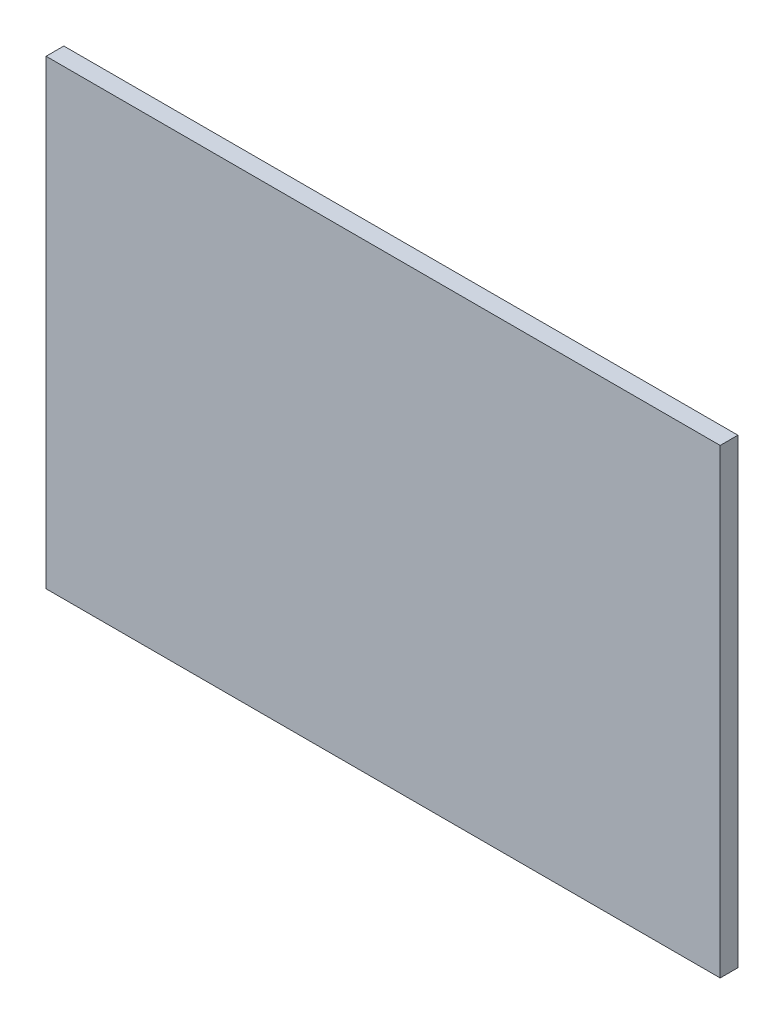
ISO-10303-21;
HEADER;
FILE_DESCRIPTION(('STEP AP214'),'2;1');
FILE_NAME('part.step','',(''),(''),'','','');
FILE_SCHEMA(('AUTOMOTIVE_DESIGN { 1 0 10303 214 1 1 1 1 }'));
ENDSEC;
DATA;
#1=APPLICATION_CONTEXT('core data for automotive mechanical design processes');
#2=APPLICATION_PROTOCOL_DEFINITION('international standard','automotive_design',2000,#1);
#3=PRODUCT_CONTEXT('',#1,'mechanical');
#4=PRODUCT('Part','Part','',(#3));
#5=PRODUCT_RELATED_PRODUCT_CATEGORY('part','',(#4));
#6=PRODUCT_DEFINITION_FORMATION('','',#4);
#7=PRODUCT_DEFINITION_CONTEXT('part definition',#1,'design');
#8=PRODUCT_DEFINITION('design','',#6,#7);
#9=PRODUCT_DEFINITION_SHAPE('','',#8);
#10=(LENGTH_UNIT() NAMED_UNIT(*) SI_UNIT(.MILLI.,.METRE.));
#11=(NAMED_UNIT(*) PLANE_ANGLE_UNIT() SI_UNIT($,.RADIAN.));
#12=(NAMED_UNIT(*) SI_UNIT($,.STERADIAN.) SOLID_ANGLE_UNIT());
#13=UNCERTAINTY_MEASURE_WITH_UNIT(LENGTH_MEASURE(1.E-05),#10,'distance_accuracy_value','');
#14=(GEOMETRIC_REPRESENTATION_CONTEXT(3) GLOBAL_UNCERTAINTY_ASSIGNED_CONTEXT((#13)) GLOBAL_UNIT_ASSIGNED_CONTEXT((#10,
#11,#12)) REPRESENTATION_CONTEXT('',''));
#15=CARTESIAN_POINT('',(0.,0.,0.));
#16=DIRECTION('',(0.,0.,1.));
#17=DIRECTION('',(1.,0.,0.));
#18=AXIS2_PLACEMENT_3D('',#15,#16,#17);
#19=CARTESIAN_POINT('',(0.,0.,1.));
#20=DIRECTION('',(1.,0.,0.));
#21=DIRECTION('',(0.,0.,-1.));
#22=AXIS2_PLACEMENT_3D('',#19,#20,#21);
#23=PLANE('',#22);
#24=DIRECTION('',(0.,-1.,0.));
#25=VECTOR('',#24,1.);
#26=CARTESIAN_POINT('',(0.,0.,0.));
#27=LINE('',#26,#25);
#28=CARTESIAN_POINT('',(0.,26.,0.));
#29=VERTEX_POINT('',#28);
#30=CARTESIAN_POINT('',(0.,0.,0.));
#31=VERTEX_POINT('',#30);
#32=EDGE_CURVE('E107',#29,#31,#27,.T.);
#33=ORIENTED_EDGE('',*,*,#32,.T.);
#34=DIRECTION('',(0.,0.,-1.));
#35=VECTOR('',#34,1.);
#36=CARTESIAN_POINT('',(0.,0.,1.));
#37=LINE('',#36,#35);
#38=CARTESIAN_POINT('',(0.,0.,1.));
#39=VERTEX_POINT('',#38);
#40=EDGE_CURVE('E11',#39,#31,#37,.T.);
#41=ORIENTED_EDGE('',*,*,#40,.F.);
#42=DIRECTION('',(0.,-1.,0.));
#43=VECTOR('',#42,1.);
#44=CARTESIAN_POINT('',(0.,0.,1.));
#45=LINE('',#44,#43);
#46=CARTESIAN_POINT('',(0.,26.,1.));
#47=VERTEX_POINT('',#46);
#48=EDGE_CURVE('E91',#47,#39,#45,.T.);
#49=ORIENTED_EDGE('',*,*,#48,.F.);
#50=DIRECTION('',(0.,0.,-1.));
#51=VECTOR('',#50,1.);
#52=CARTESIAN_POINT('',(0.,26.,1.));
#53=LINE('',#52,#51);
#54=EDGE_CURVE('E103',#47,#29,#53,.T.);
#55=ORIENTED_EDGE('',*,*,#54,.T.);
#56=EDGE_LOOP('',(#33,#41,#49,#55));
#57=FACE_BOUND('',#56,.T.);
#58=ADVANCED_FACE('F39',(#57),#23,.F.);
#59=CARTESIAN_POINT('',(0.,0.,1.));
#60=DIRECTION('',(0.,1.,0.));
#61=DIRECTION('',(0.,0.,1.));
#62=AXIS2_PLACEMENT_3D('',#59,#60,#61);
#63=PLANE('',#62);
#64=DIRECTION('',(1.,0.,0.));
#65=VECTOR('',#64,1.);
#66=CARTESIAN_POINT('',(0.,0.,0.));
#67=LINE('',#66,#65);
#68=CARTESIAN_POINT('',(38.,0.,0.));
#69=VERTEX_POINT('',#68);
#70=EDGE_CURVE('E96',#31,#69,#67,.T.);
#71=ORIENTED_EDGE('',*,*,#70,.T.);
#72=DIRECTION('',(0.,0.,-1.));
#73=VECTOR('',#72,1.);
#74=CARTESIAN_POINT('',(38.,0.,1.));
#75=LINE('',#74,#73);
#76=CARTESIAN_POINT('',(38.,0.,1.));
#77=VERTEX_POINT('',#76);
#78=EDGE_CURVE('E48',#77,#69,#75,.T.);
#79=ORIENTED_EDGE('',*,*,#78,.F.);
#80=DIRECTION('',(1.,0.,0.));
#81=VECTOR('',#80,1.);
#82=CARTESIAN_POINT('',(0.,0.,1.));
#83=LINE('',#82,#81);
#84=EDGE_CURVE('E86',#39,#77,#83,.T.);
#85=ORIENTED_EDGE('',*,*,#84,.F.);
#86=ORIENTED_EDGE('',*,*,#40,.T.);
#87=EDGE_LOOP('',(#71,#79,#85,#86));
#88=FACE_BOUND('',#87,.T.);
#89=ADVANCED_FACE('F95',(#88),#63,.F.);
#90=CARTESIAN_POINT('',(38.,0.,1.));
#91=DIRECTION('',(-1.,0.,0.));
#92=DIRECTION('',(0.,0.,1.));
#93=AXIS2_PLACEMENT_3D('',#90,#91,#92);
#94=PLANE('',#93);
#95=DIRECTION('',(0.,1.,0.));
#96=VECTOR('',#95,1.);
#97=CARTESIAN_POINT('',(38.,0.,0.));
#98=LINE('',#97,#96);
#99=CARTESIAN_POINT('',(38.,26.,0.));
#100=VERTEX_POINT('',#99);
#101=EDGE_CURVE('E73',#69,#100,#98,.T.);
#102=ORIENTED_EDGE('',*,*,#101,.T.);
#103=DIRECTION('',(0.,0.,-1.));
#104=VECTOR('',#103,1.);
#105=CARTESIAN_POINT('',(38.,26.,1.));
#106=LINE('',#105,#104);
#107=CARTESIAN_POINT('',(38.,26.,1.));
#108=VERTEX_POINT('',#107);
#109=EDGE_CURVE('E98',#108,#100,#106,.T.);
#110=ORIENTED_EDGE('',*,*,#109,.F.);
#111=DIRECTION('',(0.,1.,0.));
#112=VECTOR('',#111,1.);
#113=CARTESIAN_POINT('',(38.,0.,1.));
#114=LINE('',#113,#112);
#115=EDGE_CURVE('E89',#77,#108,#114,.T.);
#116=ORIENTED_EDGE('',*,*,#115,.F.);
#117=ORIENTED_EDGE('',*,*,#78,.T.);
#118=EDGE_LOOP('',(#102,#110,#116,#117));
#119=FACE_BOUND('',#118,.T.);
#120=ADVANCED_FACE('F99',(#119),#94,.F.);
#121=CARTESIAN_POINT('',(0.,26.,1.));
#122=DIRECTION('',(0.,-1.,0.));
#123=DIRECTION('',(0.,0.,-1.));
#124=AXIS2_PLACEMENT_3D('',#121,#122,#123);
#125=PLANE('',#124);
#126=DIRECTION('',(-1.,0.,0.));
#127=VECTOR('',#126,1.);
#128=CARTESIAN_POINT('',(0.,26.,0.));
#129=LINE('',#128,#127);
#130=EDGE_CURVE('E79',#100,#29,#129,.T.);
#131=ORIENTED_EDGE('',*,*,#130,.T.);
#132=ORIENTED_EDGE('',*,*,#54,.F.);
#133=DIRECTION('',(-1.,0.,0.));
#134=VECTOR('',#133,1.);
#135=CARTESIAN_POINT('',(0.,26.,1.));
#136=LINE('',#135,#134);
#137=EDGE_CURVE('E56',#108,#47,#136,.T.);
#138=ORIENTED_EDGE('',*,*,#137,.F.);
#139=ORIENTED_EDGE('',*,*,#109,.T.);
#140=EDGE_LOOP('',(#131,#132,#138,#139));
#141=FACE_BOUND('',#140,.T.);
#142=ADVANCED_FACE('F120',(#141),#125,.F.);
#143=CARTESIAN_POINT('',(0.,0.,1.));
#144=DIRECTION('',(0.,0.,-1.));
#145=DIRECTION('',(-1.,0.,0.));
#146=AXIS2_PLACEMENT_3D('',#143,#144,#145);
#147=PLANE('',#146);
#148=ORIENTED_EDGE('',*,*,#48,.T.);
#149=ORIENTED_EDGE('',*,*,#84,.T.);
#150=ORIENTED_EDGE('',*,*,#115,.T.);
#151=ORIENTED_EDGE('',*,*,#137,.T.);
#152=EDGE_LOOP('',(#148,#149,#150,#151));
#153=FACE_BOUND('',#152,.T.);
#154=ADVANCED_FACE('F87',(#153),#147,.F.);
#155=CARTESIAN_POINT('',(0.,0.,0.));
#156=DIRECTION('',(0.,0.,-1.));
#157=DIRECTION('',(-1.,0.,0.));
#158=AXIS2_PLACEMENT_3D('',#155,#156,#157);
#159=PLANE('',#158);
#160=ORIENTED_EDGE('',*,*,#32,.F.);
#161=ORIENTED_EDGE('',*,*,#130,.F.);
#162=ORIENTED_EDGE('',*,*,#101,.F.);
#163=ORIENTED_EDGE('',*,*,#70,.F.);
#164=EDGE_LOOP('',(#160,#161,#162,#163));
#165=FACE_BOUND('',#164,.T.);
#166=ADVANCED_FACE('F123',(#165),#159,.T.);
#167=CLOSED_SHELL('',(#58,#89,#120,#142,#154,#166));
#168=MANIFOLD_SOLID_BREP('B2',#167);
#169=ADVANCED_BREP_SHAPE_REPRESENTATION('',(#18,#168),#14);
#170=SHAPE_DEFINITION_REPRESENTATION(#9,#169);
ENDSEC;
END-ISO-10303-21;
